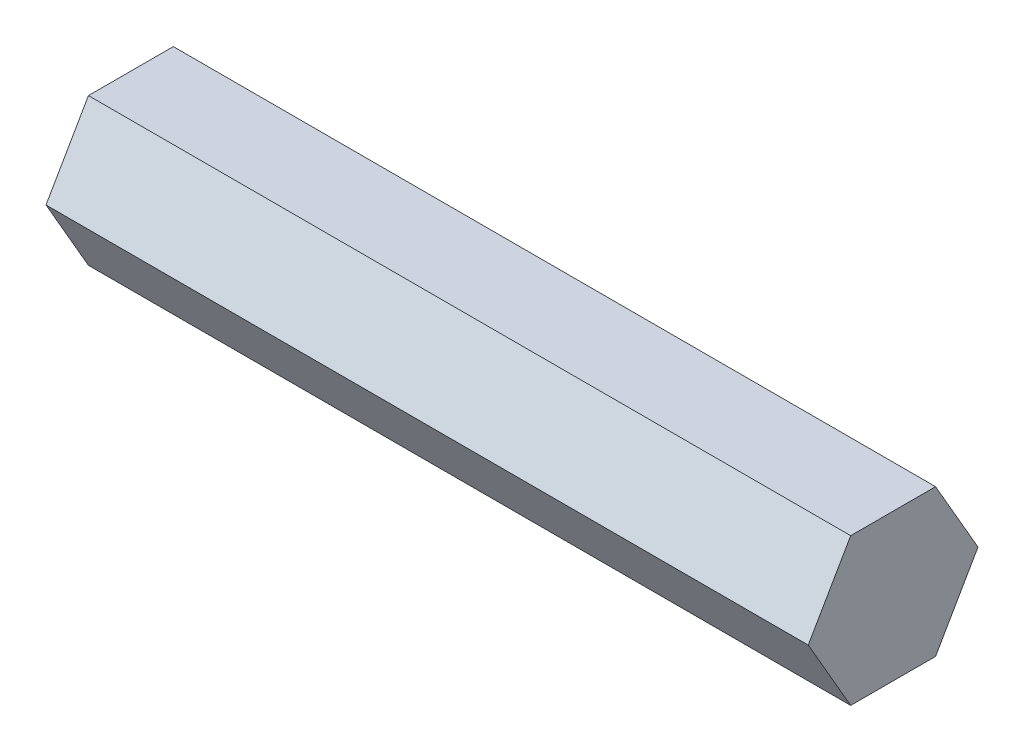
ISO-10303-21;
HEADER;
FILE_DESCRIPTION(('STEP AP214'),'2;1');
FILE_NAME('part.step','',(''),(''),'','','');
FILE_SCHEMA(('AUTOMOTIVE_DESIGN { 1 0 10303 214 1 1 1 1 }'));
ENDSEC;
DATA;
#1=APPLICATION_CONTEXT('core data for automotive mechanical design processes');
#2=APPLICATION_PROTOCOL_DEFINITION('international standard','automotive_design',2000,#1);
#3=PRODUCT_CONTEXT('',#1,'mechanical');
#4=PRODUCT('Part','Part','',(#3));
#5=PRODUCT_RELATED_PRODUCT_CATEGORY('part','',(#4));
#6=PRODUCT_DEFINITION_FORMATION('','',#4);
#7=PRODUCT_DEFINITION_CONTEXT('part definition',#1,'design');
#8=PRODUCT_DEFINITION('design','',#6,#7);
#9=PRODUCT_DEFINITION_SHAPE('','',#8);
#10=(LENGTH_UNIT() NAMED_UNIT(*) SI_UNIT(.MILLI.,.METRE.));
#11=(NAMED_UNIT(*) PLANE_ANGLE_UNIT() SI_UNIT($,.RADIAN.));
#12=(NAMED_UNIT(*) SI_UNIT($,.STERADIAN.) SOLID_ANGLE_UNIT());
#13=UNCERTAINTY_MEASURE_WITH_UNIT(LENGTH_MEASURE(1.E-05),#10,'distance_accuracy_value','');
#14=(GEOMETRIC_REPRESENTATION_CONTEXT(3) GLOBAL_UNCERTAINTY_ASSIGNED_CONTEXT((#13)) GLOBAL_UNIT_ASSIGNED_CONTEXT((#10,
#11,#12)) REPRESENTATION_CONTEXT('',''));
#15=CARTESIAN_POINT('',(0.,0.,0.));
#16=DIRECTION('',(0.,0.,1.));
#17=DIRECTION('',(1.,0.,0.));
#18=AXIS2_PLACEMENT_3D('',#15,#16,#17);
#19=CARTESIAN_POINT('',(65.85,-6.34999999999996,-3.6661742093542));
#20=DIRECTION('',(0.,0.499999999999995,0.866025403784442));
#21=DIRECTION('',(0.,-0.866025403784442,0.499999999999995));
#22=AXIS2_PLACEMENT_3D('',#19,#20,#21);
#23=PLANE('',#22);
#24=DIRECTION('',(0.,0.866025403784442,-0.499999999999995));
#25=VECTOR('',#24,1.);
#26=CARTESIAN_POINT('',(0.,-6.34999999999996,-3.6661742093542));
#27=LINE('',#26,#25);
#28=CARTESIAN_POINT('',(0.,-6.34999999999996,-3.6661742093542));
#29=VERTEX_POINT('',#28);
#30=CARTESIAN_POINT('',(0.,0.,-7.33234841870825));
#31=VERTEX_POINT('',#30);
#32=EDGE_CURVE('E123',#29,#31,#27,.T.);
#33=ORIENTED_EDGE('',*,*,#32,.T.);
#34=DIRECTION('',(-1.,0.,0.));
#35=VECTOR('',#34,1.);
#36=CARTESIAN_POINT('',(65.85,0.,-7.33234841870825));
#37=LINE('',#36,#35);
#38=CARTESIAN_POINT('',(65.85,0.,-7.33234841870825));
#39=VERTEX_POINT('',#38);
#40=EDGE_CURVE('E11',#39,#31,#37,.T.);
#41=ORIENTED_EDGE('',*,*,#40,.F.);
#42=DIRECTION('',(0.,0.866025403784442,-0.499999999999995));
#43=VECTOR('',#42,1.);
#44=CARTESIAN_POINT('',(65.85,-6.34999999999996,-3.6661742093542));
#45=LINE('',#44,#43);
#46=CARTESIAN_POINT('',(65.85,-6.34999999999996,-3.6661742093542));
#47=VERTEX_POINT('',#46);
#48=EDGE_CURVE('E135',#47,#39,#45,.T.);
#49=ORIENTED_EDGE('',*,*,#48,.F.);
#50=DIRECTION('',(-1.,0.,0.));
#51=VECTOR('',#50,1.);
#52=CARTESIAN_POINT('',(65.85,-6.34999999999996,-3.6661742093542));
#53=LINE('',#52,#51);
#54=EDGE_CURVE('E118',#47,#29,#53,.T.);
#55=ORIENTED_EDGE('',*,*,#54,.T.);
#56=EDGE_LOOP('',(#33,#41,#49,#55));
#57=FACE_BOUND('',#56,.T.);
#58=ADVANCED_FACE('F39',(#57),#23,.F.);
#59=CARTESIAN_POINT('',(65.85,0.,-7.33234841870825));
#60=DIRECTION('',(0.,-0.500000000000001,0.866025403784438));
#61=DIRECTION('',(0.,-0.866025403784438,-0.500000000000001));
#62=AXIS2_PLACEMENT_3D('',#59,#60,#61);
#63=PLANE('',#62);
#64=DIRECTION('',(0.,0.866025403784438,0.500000000000001));
#65=VECTOR('',#64,1.);
#66=CARTESIAN_POINT('',(0.,0.,-7.33234841870825));
#67=LINE('',#66,#65);
#68=CARTESIAN_POINT('',(0.,6.35000000000001,-3.66617420935411));
#69=VERTEX_POINT('',#68);
#70=EDGE_CURVE('E127',#31,#69,#67,.T.);
#71=ORIENTED_EDGE('',*,*,#70,.T.);
#72=DIRECTION('',(-1.,0.,0.));
#73=VECTOR('',#72,1.);
#74=CARTESIAN_POINT('',(65.85,6.35000000000001,-3.66617420935411));
#75=LINE('',#74,#73);
#76=CARTESIAN_POINT('',(65.85,6.35000000000001,-3.66617420935411));
#77=VERTEX_POINT('',#76);
#78=EDGE_CURVE('E50',#77,#69,#75,.T.);
#79=ORIENTED_EDGE('',*,*,#78,.F.);
#80=DIRECTION('',(0.,0.866025403784438,0.500000000000001));
#81=VECTOR('',#80,1.);
#82=CARTESIAN_POINT('',(65.85,0.,-7.33234841870825));
#83=LINE('',#82,#81);
#84=EDGE_CURVE('E95',#39,#77,#83,.T.);
#85=ORIENTED_EDGE('',*,*,#84,.F.);
#86=ORIENTED_EDGE('',*,*,#40,.T.);
#87=EDGE_LOOP('',(#71,#79,#85,#86));
#88=FACE_BOUND('',#87,.T.);
#89=ADVANCED_FACE('F160',(#88),#63,.F.);
#90=CARTESIAN_POINT('',(65.85,6.35000000000001,-3.66617420935411));
#91=DIRECTION('',(0.,-1.,0.));
#92=DIRECTION('',(0.,0.,-1.));
#93=AXIS2_PLACEMENT_3D('',#90,#91,#92);
#94=PLANE('',#93);
#95=DIRECTION('',(0.,0.,1.));
#96=VECTOR('',#95,1.);
#97=CARTESIAN_POINT('',(0.,6.35000000000001,-3.66617420935411));
#98=LINE('',#97,#96);
#99=CARTESIAN_POINT('',(0.,6.34999999999999,3.66617420935415));
#100=VERTEX_POINT('',#99);
#101=EDGE_CURVE('E126',#69,#100,#98,.T.);
#102=ORIENTED_EDGE('',*,*,#101,.T.);
#103=DIRECTION('',(-1.,0.,0.));
#104=VECTOR('',#103,1.);
#105=CARTESIAN_POINT('',(65.85,6.34999999999999,3.66617420935415));
#106=LINE('',#105,#104);
#107=CARTESIAN_POINT('',(65.85,6.34999999999999,3.66617420935415));
#108=VERTEX_POINT('',#107);
#109=EDGE_CURVE('E111',#108,#100,#106,.T.);
#110=ORIENTED_EDGE('',*,*,#109,.F.);
#111=DIRECTION('',(0.,0.,1.));
#112=VECTOR('',#111,1.);
#113=CARTESIAN_POINT('',(65.85,6.35000000000001,-3.66617420935411));
#114=LINE('',#113,#112);
#115=EDGE_CURVE('E104',#77,#108,#114,.T.);
#116=ORIENTED_EDGE('',*,*,#115,.F.);
#117=ORIENTED_EDGE('',*,*,#78,.T.);
#118=EDGE_LOOP('',(#102,#110,#116,#117));
#119=FACE_BOUND('',#118,.T.);
#120=ADVANCED_FACE('F139',(#119),#94,.F.);
#121=CARTESIAN_POINT('',(65.85,6.34999999999999,3.66617420935415));
#122=DIRECTION('',(0.,-0.499999999999995,-0.866025403784442));
#123=DIRECTION('',(0.,0.866025403784442,-0.499999999999995));
#124=AXIS2_PLACEMENT_3D('',#121,#122,#123);
#125=PLANE('',#124);
#126=DIRECTION('',(0.,-0.866025403784442,0.499999999999995));
#127=VECTOR('',#126,1.);
#128=CARTESIAN_POINT('',(0.,6.34999999999999,3.66617420935415));
#129=LINE('',#128,#127);
#130=CARTESIAN_POINT('',(0.,0.,7.33234841870825));
#131=VERTEX_POINT('',#130);
#132=EDGE_CURVE('E114',#100,#131,#129,.T.);
#133=ORIENTED_EDGE('',*,*,#132,.T.);
#134=DIRECTION('',(-1.,0.,0.));
#135=VECTOR('',#134,1.);
#136=CARTESIAN_POINT('',(65.85,0.,7.33234841870825));
#137=LINE('',#136,#135);
#138=CARTESIAN_POINT('',(65.85,0.,7.33234841870825));
#139=VERTEX_POINT('',#138);
#140=EDGE_CURVE('E109',#139,#131,#137,.T.);
#141=ORIENTED_EDGE('',*,*,#140,.F.);
#142=DIRECTION('',(0.,-0.866025403784442,0.499999999999995));
#143=VECTOR('',#142,1.);
#144=CARTESIAN_POINT('',(65.85,6.34999999999999,3.66617420935415));
#145=LINE('',#144,#143);
#146=EDGE_CURVE('E97',#108,#139,#145,.T.);
#147=ORIENTED_EDGE('',*,*,#146,.F.);
#148=ORIENTED_EDGE('',*,*,#109,.T.);
#149=EDGE_LOOP('',(#133,#141,#147,#148));
#150=FACE_BOUND('',#149,.T.);
#151=ADVANCED_FACE('F112',(#150),#125,.F.);
#152=CARTESIAN_POINT('',(65.85,0.,7.33234841870825));
#153=DIRECTION('',(0.,0.500000000000007,-0.866025403784435));
#154=DIRECTION('',(0.,0.866025403784435,0.500000000000007));
#155=AXIS2_PLACEMENT_3D('',#152,#153,#154);
#156=PLANE('',#155);
#157=DIRECTION('',(0.,-0.866025403784434,-0.500000000000007));
#158=VECTOR('',#157,1.);
#159=CARTESIAN_POINT('',(0.,0.,7.33234841870825));
#160=LINE('',#159,#158);
#161=CARTESIAN_POINT('',(0.,-6.35000000000004,3.66617420935407));
#162=VERTEX_POINT('',#161);
#163=EDGE_CURVE('E80',#131,#162,#160,.T.);
#164=ORIENTED_EDGE('',*,*,#163,.T.);
#165=DIRECTION('',(-1.,0.,0.));
#166=VECTOR('',#165,1.);
#167=CARTESIAN_POINT('',(65.85,-6.35000000000004,3.66617420935407));
#168=LINE('',#167,#166);
#169=CARTESIAN_POINT('',(65.85,-6.35000000000004,3.66617420935407));
#170=VERTEX_POINT('',#169);
#171=EDGE_CURVE('E113',#170,#162,#168,.T.);
#172=ORIENTED_EDGE('',*,*,#171,.F.);
#173=DIRECTION('',(0.,-0.866025403784434,-0.500000000000007));
#174=VECTOR('',#173,1.);
#175=CARTESIAN_POINT('',(65.85,0.,7.33234841870825));
#176=LINE('',#175,#174);
#177=EDGE_CURVE('E103',#139,#170,#176,.T.);
#178=ORIENTED_EDGE('',*,*,#177,.F.);
#179=ORIENTED_EDGE('',*,*,#140,.T.);
#180=EDGE_LOOP('',(#164,#172,#178,#179));
#181=FACE_BOUND('',#180,.T.);
#182=ADVANCED_FACE('F116',(#181),#156,.F.);
#183=CARTESIAN_POINT('',(65.85,-6.35000000000004,3.66617420935407));
#184=DIRECTION('',(0.,1.,0.));
#185=DIRECTION('',(0.,0.,1.));
#186=AXIS2_PLACEMENT_3D('',#183,#184,#185);
#187=PLANE('',#186);
#188=DIRECTION('',(0.,0.,-1.));
#189=VECTOR('',#188,1.);
#190=CARTESIAN_POINT('',(0.,-6.35000000000004,3.66617420935407));
#191=LINE('',#190,#189);
#192=EDGE_CURVE('E84',#162,#29,#191,.T.);
#193=ORIENTED_EDGE('',*,*,#192,.T.);
#194=ORIENTED_EDGE('',*,*,#54,.F.);
#195=DIRECTION('',(0.,0.,-1.));
#196=VECTOR('',#195,1.);
#197=CARTESIAN_POINT('',(65.85,-6.35000000000004,3.66617420935407));
#198=LINE('',#197,#196);
#199=EDGE_CURVE('E54',#170,#47,#198,.T.);
#200=ORIENTED_EDGE('',*,*,#199,.F.);
#201=ORIENTED_EDGE('',*,*,#171,.T.);
#202=EDGE_LOOP('',(#193,#194,#200,#201));
#203=FACE_BOUND('',#202,.T.);
#204=ADVANCED_FACE('F148',(#203),#187,.F.);
#205=CARTESIAN_POINT('',(65.85,0.,0.));
#206=DIRECTION('',(1.,0.,0.));
#207=DIRECTION('',(0.,0.,-1.));
#208=AXIS2_PLACEMENT_3D('',#205,#206,#207);
#209=PLANE('',#208);
#210=ORIENTED_EDGE('',*,*,#48,.T.);
#211=ORIENTED_EDGE('',*,*,#84,.T.);
#212=ORIENTED_EDGE('',*,*,#115,.T.);
#213=ORIENTED_EDGE('',*,*,#146,.T.);
#214=ORIENTED_EDGE('',*,*,#177,.T.);
#215=ORIENTED_EDGE('',*,*,#199,.T.);
#216=EDGE_LOOP('',(#210,#211,#212,#213,#214,#215));
#217=FACE_BOUND('',#216,.T.);
#218=ADVANCED_FACE('F101',(#217),#209,.T.);
#219=CARTESIAN_POINT('',(0.,0.,0.));
#220=DIRECTION('',(1.,0.,0.));
#221=DIRECTION('',(0.,0.,-1.));
#222=AXIS2_PLACEMENT_3D('',#219,#220,#221);
#223=PLANE('',#222);
#224=ORIENTED_EDGE('',*,*,#32,.F.);
#225=ORIENTED_EDGE('',*,*,#192,.F.);
#226=ORIENTED_EDGE('',*,*,#163,.F.);
#227=ORIENTED_EDGE('',*,*,#132,.F.);
#228=ORIENTED_EDGE('',*,*,#101,.F.);
#229=ORIENTED_EDGE('',*,*,#70,.F.);
#230=EDGE_LOOP('',(#224,#225,#226,#227,#228,#229));
#231=FACE_BOUND('',#230,.T.);
#232=ADVANCED_FACE('F142',(#231),#223,.F.);
#233=CLOSED_SHELL('',(#58,#89,#120,#151,#182,#204,#218,#232));
#234=MANIFOLD_SOLID_BREP('B2',#233);
#235=ADVANCED_BREP_SHAPE_REPRESENTATION('',(#18,#234),#14);
#236=SHAPE_DEFINITION_REPRESENTATION(#9,#235);
ENDSEC;
END-ISO-10303-21;
